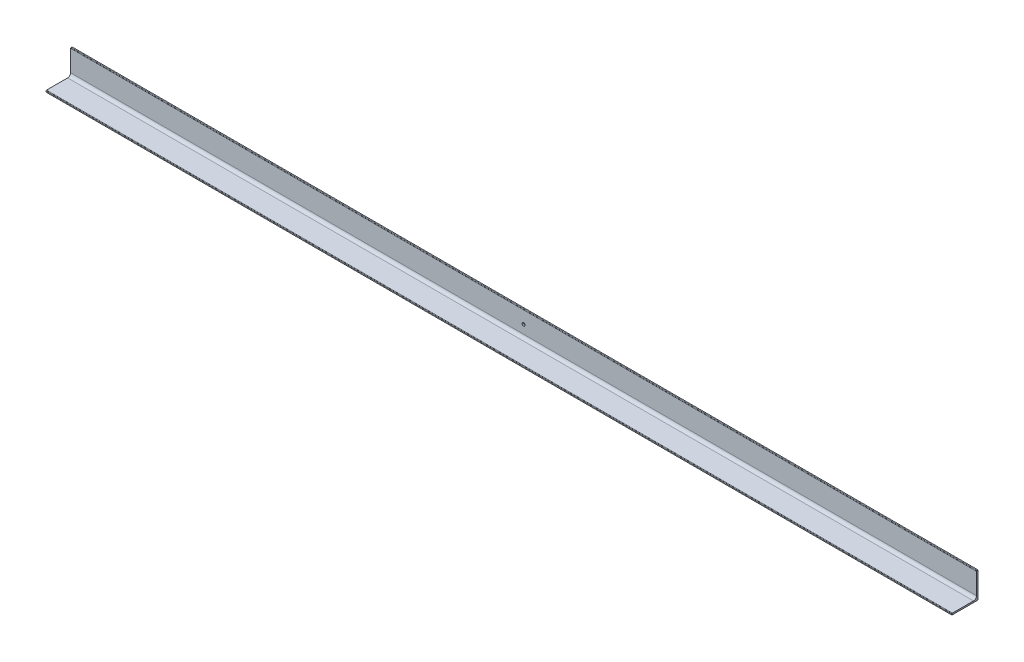
ISO-10303-21;
HEADER;
FILE_DESCRIPTION(('STEP AP214'),'2;1');
FILE_NAME('part.step','',(''),(''),'','','');
FILE_SCHEMA(('AUTOMOTIVE_DESIGN { 1 0 10303 214 1 1 1 1 }'));
ENDSEC;
DATA;
#1=APPLICATION_CONTEXT('core data for automotive mechanical design processes');
#2=APPLICATION_PROTOCOL_DEFINITION('international standard','automotive_design',2000,#1);
#3=PRODUCT_CONTEXT('',#1,'mechanical');
#4=PRODUCT('Part','Part','',(#3));
#5=PRODUCT_RELATED_PRODUCT_CATEGORY('part','',(#4));
#6=PRODUCT_DEFINITION_FORMATION('','',#4);
#7=PRODUCT_DEFINITION_CONTEXT('part definition',#1,'design');
#8=PRODUCT_DEFINITION('design','',#6,#7);
#9=PRODUCT_DEFINITION_SHAPE('','',#8);
#10=(LENGTH_UNIT() NAMED_UNIT(*) SI_UNIT(.MILLI.,.METRE.));
#11=(NAMED_UNIT(*) PLANE_ANGLE_UNIT() SI_UNIT($,.RADIAN.));
#12=(NAMED_UNIT(*) SI_UNIT($,.STERADIAN.) SOLID_ANGLE_UNIT());
#13=UNCERTAINTY_MEASURE_WITH_UNIT(LENGTH_MEASURE(1.E-05),#10,'distance_accuracy_value','');
#14=(GEOMETRIC_REPRESENTATION_CONTEXT(3) GLOBAL_UNCERTAINTY_ASSIGNED_CONTEXT((#13)) GLOBAL_UNIT_ASSIGNED_CONTEXT((#10,
#11,#12)) REPRESENTATION_CONTEXT('',''));
#15=CARTESIAN_POINT('',(0.,0.,0.));
#16=DIRECTION('',(0.,0.,1.));
#17=DIRECTION('',(1.,0.,0.));
#18=AXIS2_PLACEMENT_3D('',#15,#16,#17);
#19=CARTESIAN_POINT('',(1215.,0.,70.));
#20=DIRECTION('',(0.,0.,-1.));
#21=DIRECTION('',(-1.,0.,0.));
#22=AXIS2_PLACEMENT_3D('',#19,#20,#21);
#23=PLANE('',#22);
#24=DIRECTION('',(0.,-1.,0.));
#25=VECTOR('',#24,1.);
#26=CARTESIAN_POINT('',(-1215.,0.,70.));
#27=LINE('',#26,#25);
#28=CARTESIAN_POINT('',(-1215.,2.66666666666667,70.));
#29=VERTEX_POINT('',#28);
#30=CARTESIAN_POINT('',(-1215.,0.,70.));
#31=VERTEX_POINT('',#30);
#32=EDGE_CURVE('E135',#29,#31,#27,.T.);
#33=ORIENTED_EDGE('',*,*,#32,.T.);
#34=DIRECTION('',(-1.,0.,0.));
#35=VECTOR('',#34,1.);
#36=CARTESIAN_POINT('',(1215.,0.,70.));
#37=LINE('',#36,#35);
#38=CARTESIAN_POINT('',(1215.,0.,70.));
#39=VERTEX_POINT('',#38);
#40=EDGE_CURVE('E11',#39,#31,#37,.T.);
#41=ORIENTED_EDGE('',*,*,#40,.F.);
#42=DIRECTION('',(0.,-1.,0.));
#43=VECTOR('',#42,1.);
#44=CARTESIAN_POINT('',(1215.,0.,70.));
#45=LINE('',#44,#43);
#46=CARTESIAN_POINT('',(1215.,2.66666666666667,70.));
#47=VERTEX_POINT('',#46);
#48=EDGE_CURVE('E152',#47,#39,#45,.T.);
#49=ORIENTED_EDGE('',*,*,#48,.F.);
#50=DIRECTION('',(-1.,0.,0.));
#51=VECTOR('',#50,1.);
#52=CARTESIAN_POINT('',(1215.,2.66666666666667,70.));
#53=LINE('',#52,#51);
#54=EDGE_CURVE('E131',#47,#29,#53,.T.);
#55=ORIENTED_EDGE('',*,*,#54,.T.);
#56=EDGE_LOOP('',(#33,#41,#49,#55));
#57=FACE_BOUND('',#56,.T.);
#58=ADVANCED_FACE('F33',(#57),#23,.F.);
#59=CARTESIAN_POINT('',(1215.,0.,70.));
#60=DIRECTION('',(0.,1.,0.));
#61=DIRECTION('',(0.,0.,1.));
#62=AXIS2_PLACEMENT_3D('',#59,#60,#61);
#63=PLANE('',#62);
#64=DIRECTION('',(0.,0.,-1.));
#65=VECTOR('',#64,1.);
#66=CARTESIAN_POINT('',(-1215.,0.,70.));
#67=LINE('',#66,#65);
#68=CARTESIAN_POINT('',(-1215.,0.,0.));
#69=VERTEX_POINT('',#68);
#70=EDGE_CURVE('E138',#31,#69,#67,.T.);
#71=ORIENTED_EDGE('',*,*,#70,.T.);
#72=DIRECTION('',(-1.,0.,0.));
#73=VECTOR('',#72,1.);
#74=CARTESIAN_POINT('',(1215.,0.,0.));
#75=LINE('',#74,#73);
#76=CARTESIAN_POINT('',(1215.,0.,0.));
#77=VERTEX_POINT('',#76);
#78=EDGE_CURVE('E41',#77,#69,#75,.T.);
#79=ORIENTED_EDGE('',*,*,#78,.F.);
#80=DIRECTION('',(0.,0.,-1.));
#81=VECTOR('',#80,1.);
#82=CARTESIAN_POINT('',(1215.,0.,70.));
#83=LINE('',#82,#81);
#84=EDGE_CURVE('E95',#39,#77,#83,.T.);
#85=ORIENTED_EDGE('',*,*,#84,.F.);
#86=ORIENTED_EDGE('',*,*,#40,.T.);
#87=EDGE_LOOP('',(#71,#79,#85,#86));
#88=FACE_BOUND('',#87,.T.);
#89=ADVANCED_FACE('F224',(#88),#63,.F.);
#90=CARTESIAN_POINT('',(1215.,0.,0.));
#91=DIRECTION('',(0.,0.,1.));
#92=DIRECTION('',(1.,0.,0.));
#93=AXIS2_PLACEMENT_3D('',#90,#91,#92);
#94=PLANE('',#93);
#95=CARTESIAN_POINT('',(0.,35.,0.));
#96=DIRECTION('',(0.,0.,1.));
#97=DIRECTION('',(1.,0.,0.));
#98=AXIS2_PLACEMENT_3D('',#95,#96,#97);
#99=CIRCLE('',#98,4.);
#100=CARTESIAN_POINT('',(4.,35.,0.));
#101=VERTEX_POINT('',#100);
#102=EDGE_CURVE('E139',#101,#101,#99,.T.);
#103=ORIENTED_EDGE('',*,*,#102,.T.);
#104=EDGE_LOOP('',(#103));
#105=FACE_BOUND('',#104,.T.);
#106=DIRECTION('',(0.,1.,0.));
#107=VECTOR('',#106,1.);
#108=CARTESIAN_POINT('',(-1215.,0.,0.));
#109=LINE('',#108,#107);
#110=CARTESIAN_POINT('',(-1215.,70.,0.));
#111=VERTEX_POINT('',#110);
#112=EDGE_CURVE('E141',#69,#111,#109,.T.);
#113=ORIENTED_EDGE('',*,*,#112,.T.);
#114=DIRECTION('',(-1.,0.,0.));
#115=VECTOR('',#114,1.);
#116=CARTESIAN_POINT('',(1215.,70.,0.));
#117=LINE('',#116,#115);
#118=CARTESIAN_POINT('',(1215.,70.,0.));
#119=VERTEX_POINT('',#118);
#120=EDGE_CURVE('E162',#119,#111,#117,.T.);
#121=ORIENTED_EDGE('',*,*,#120,.F.);
#122=DIRECTION('',(0.,1.,0.));
#123=VECTOR('',#122,1.);
#124=CARTESIAN_POINT('',(1215.,0.,0.));
#125=LINE('',#124,#123);
#126=EDGE_CURVE('E170',#77,#119,#125,.T.);
#127=ORIENTED_EDGE('',*,*,#126,.F.);
#128=ORIENTED_EDGE('',*,*,#78,.T.);
#129=EDGE_LOOP('',(#113,#121,#127,#128));
#130=FACE_BOUND('',#129,.T.);
#131=ADVANCED_FACE('F168',(#105,#130),#94,.F.);
#132=CARTESIAN_POINT('',(1215.,70.,0.));
#133=DIRECTION('',(0.,-1.,0.));
#134=DIRECTION('',(0.,0.,-1.));
#135=AXIS2_PLACEMENT_3D('',#132,#133,#134);
#136=PLANE('',#135);
#137=DIRECTION('',(0.,0.,1.));
#138=VECTOR('',#137,1.);
#139=CARTESIAN_POINT('',(-1215.,70.,0.));
#140=LINE('',#139,#138);
#141=CARTESIAN_POINT('',(-1215.,70.,2.66666666666667));
#142=VERTEX_POINT('',#141);
#143=EDGE_CURVE('E143',#111,#142,#140,.T.);
#144=ORIENTED_EDGE('',*,*,#143,.T.);
#145=DIRECTION('',(-1.,0.,0.));
#146=VECTOR('',#145,1.);
#147=CARTESIAN_POINT('',(1215.,70.,2.66666666666667));
#148=LINE('',#147,#146);
#149=CARTESIAN_POINT('',(1215.,70.,2.66666666666667));
#150=VERTEX_POINT('',#149);
#151=EDGE_CURVE('E159',#150,#142,#148,.T.);
#152=ORIENTED_EDGE('',*,*,#151,.F.);
#153=DIRECTION('',(0.,0.,1.));
#154=VECTOR('',#153,1.);
#155=CARTESIAN_POINT('',(1215.,70.,0.));
#156=LINE('',#155,#154);
#157=EDGE_CURVE('E186',#119,#150,#156,.T.);
#158=ORIENTED_EDGE('',*,*,#157,.F.);
#159=ORIENTED_EDGE('',*,*,#120,.T.);
#160=EDGE_LOOP('',(#144,#152,#158,#159));
#161=FACE_BOUND('',#160,.T.);
#162=ADVANCED_FACE('F179',(#161),#136,.F.);
#163=CARTESIAN_POINT('',(1215.,68.6666666666667,2.66666666666667));
#164=DIRECTION('',(-1.,0.,0.));
#165=DIRECTION('',(0.,0.,1.));
#166=AXIS2_PLACEMENT_3D('',#163,#164,#165);
#167=CYLINDRICAL_SURFACE('',#166,1.33333333333334);
#168=CARTESIAN_POINT('',(-1215.,68.6666666666667,2.66666666666667));
#169=DIRECTION('',(1.,0.,0.));
#170=DIRECTION('',(0.,0.,-1.));
#171=AXIS2_PLACEMENT_3D('',#168,#169,#170);
#172=CIRCLE('',#171,1.33333333333334);
#173=CARTESIAN_POINT('',(-1215.,68.6666666666667,4.));
#174=VERTEX_POINT('',#173);
#175=EDGE_CURVE('E145',#142,#174,#172,.T.);
#176=ORIENTED_EDGE('',*,*,#175,.T.);
#177=DIRECTION('',(-1.,0.,0.));
#178=VECTOR('',#177,1.);
#179=CARTESIAN_POINT('',(1215.,68.6666666666667,4.));
#180=LINE('',#179,#178);
#181=CARTESIAN_POINT('',(1215.,68.6666666666667,4.));
#182=VERTEX_POINT('',#181);
#183=EDGE_CURVE('E156',#182,#174,#180,.T.);
#184=ORIENTED_EDGE('',*,*,#183,.F.);
#185=CARTESIAN_POINT('',(1215.,68.6666666666667,2.66666666666667));
#186=DIRECTION('',(1.,0.,0.));
#187=DIRECTION('',(0.,0.,-1.));
#188=AXIS2_PLACEMENT_3D('',#185,#186,#187);
#189=CIRCLE('',#188,1.33333333333334);
#190=EDGE_CURVE('E185',#150,#182,#189,.T.);
#191=ORIENTED_EDGE('',*,*,#190,.F.);
#192=ORIENTED_EDGE('',*,*,#151,.T.);
#193=EDGE_LOOP('',(#176,#184,#191,#192));
#194=FACE_BOUND('',#193,.T.);
#195=ADVANCED_FACE('F183',(#194),#167,.T.);
#196=CARTESIAN_POINT('',(1215.,12.,4.));
#197=DIRECTION('',(0.,0.,-1.));
#198=DIRECTION('',(-1.,0.,0.));
#199=AXIS2_PLACEMENT_3D('',#196,#197,#198);
#200=PLANE('',#199);
#201=CARTESIAN_POINT('',(0.,35.,4.));
#202=DIRECTION('',(0.,0.,1.));
#203=DIRECTION('',(1.,0.,0.));
#204=AXIS2_PLACEMENT_3D('',#201,#202,#203);
#205=CIRCLE('',#204,4.);
#206=CARTESIAN_POINT('',(4.,35.,4.));
#207=VERTEX_POINT('',#206);
#208=EDGE_CURVE('E193',#207,#207,#205,.T.);
#209=ORIENTED_EDGE('',*,*,#208,.F.);
#210=EDGE_LOOP('',(#209));
#211=FACE_BOUND('',#210,.T.);
#212=DIRECTION('',(0.,-1.,0.));
#213=VECTOR('',#212,1.);
#214=CARTESIAN_POINT('',(-1215.,12.,4.));
#215=LINE('',#214,#213);
#216=CARTESIAN_POINT('',(-1215.,12.,4.));
#217=VERTEX_POINT('',#216);
#218=EDGE_CURVE('E147',#174,#217,#215,.T.);
#219=ORIENTED_EDGE('',*,*,#218,.T.);
#220=DIRECTION('',(-1.,0.,0.));
#221=VECTOR('',#220,1.);
#222=CARTESIAN_POINT('',(1215.,12.,4.));
#223=LINE('',#222,#221);
#224=CARTESIAN_POINT('',(1215.,12.,4.));
#225=VERTEX_POINT('',#224);
#226=EDGE_CURVE('E126',#225,#217,#223,.T.);
#227=ORIENTED_EDGE('',*,*,#226,.F.);
#228=DIRECTION('',(0.,-1.,0.));
#229=VECTOR('',#228,1.);
#230=CARTESIAN_POINT('',(1215.,12.,4.));
#231=LINE('',#230,#229);
#232=EDGE_CURVE('E117',#182,#225,#231,.T.);
#233=ORIENTED_EDGE('',*,*,#232,.F.);
#234=ORIENTED_EDGE('',*,*,#183,.T.);
#235=EDGE_LOOP('',(#219,#227,#233,#234));
#236=FACE_BOUND('',#235,.T.);
#237=ADVANCED_FACE('F206',(#211,#236),#200,.F.);
#238=CARTESIAN_POINT('',(1215.,12.,12.));
#239=DIRECTION('',(-1.,0.,0.));
#240=DIRECTION('',(0.,0.,1.));
#241=AXIS2_PLACEMENT_3D('',#238,#239,#240);
#242=CYLINDRICAL_SURFACE('',#241,8.);
#243=CARTESIAN_POINT('',(-1215.,12.,12.));
#244=DIRECTION('',(-1.,0.,0.));
#245=DIRECTION('',(0.,0.,-1.));
#246=AXIS2_PLACEMENT_3D('',#243,#244,#245);
#247=CIRCLE('',#246,8.);
#248=CARTESIAN_POINT('',(-1215.,4.00000000000001,12.));
#249=VERTEX_POINT('',#248);
#250=EDGE_CURVE('E125',#217,#249,#247,.T.);
#251=ORIENTED_EDGE('',*,*,#250,.T.);
#252=DIRECTION('',(-1.,0.,0.));
#253=VECTOR('',#252,1.);
#254=CARTESIAN_POINT('',(1215.,4.00000000000001,12.));
#255=LINE('',#254,#253);
#256=CARTESIAN_POINT('',(1215.,4.00000000000001,12.));
#257=VERTEX_POINT('',#256);
#258=EDGE_CURVE('E122',#257,#249,#255,.T.);
#259=ORIENTED_EDGE('',*,*,#258,.F.);
#260=CARTESIAN_POINT('',(1215.,12.,12.));
#261=DIRECTION('',(-1.,0.,0.));
#262=DIRECTION('',(0.,0.,-1.));
#263=AXIS2_PLACEMENT_3D('',#260,#261,#262);
#264=CIRCLE('',#263,8.);
#265=EDGE_CURVE('E111',#225,#257,#264,.T.);
#266=ORIENTED_EDGE('',*,*,#265,.F.);
#267=ORIENTED_EDGE('',*,*,#226,.T.);
#268=EDGE_LOOP('',(#251,#259,#266,#267));
#269=FACE_BOUND('',#268,.T.);
#270=ADVANCED_FACE('F123',(#269),#242,.F.);
#271=CARTESIAN_POINT('',(1215.,4.,68.6666666666667));
#272=DIRECTION('',(0.,-1.,0.));
#273=DIRECTION('',(0.,0.,-1.));
#274=AXIS2_PLACEMENT_3D('',#271,#272,#273);
#275=PLANE('',#274);
#276=DIRECTION('',(0.,0.,1.));
#277=VECTOR('',#276,1.);
#278=CARTESIAN_POINT('',(-1215.,4.,68.6666666666667));
#279=LINE('',#278,#277);
#280=CARTESIAN_POINT('',(-1215.,4.,68.6666666666667));
#281=VERTEX_POINT('',#280);
#282=EDGE_CURVE('E81',#249,#281,#279,.T.);
#283=ORIENTED_EDGE('',*,*,#282,.T.);
#284=DIRECTION('',(-1.,0.,0.));
#285=VECTOR('',#284,1.);
#286=CARTESIAN_POINT('',(1215.,4.,68.6666666666667));
#287=LINE('',#286,#285);
#288=CARTESIAN_POINT('',(1215.,4.,68.6666666666667));
#289=VERTEX_POINT('',#288);
#290=EDGE_CURVE('E127',#289,#281,#287,.T.);
#291=ORIENTED_EDGE('',*,*,#290,.F.);
#292=DIRECTION('',(0.,0.,1.));
#293=VECTOR('',#292,1.);
#294=CARTESIAN_POINT('',(1215.,4.,68.6666666666667));
#295=LINE('',#294,#293);
#296=EDGE_CURVE('E115',#257,#289,#295,.T.);
#297=ORIENTED_EDGE('',*,*,#296,.F.);
#298=ORIENTED_EDGE('',*,*,#258,.T.);
#299=EDGE_LOOP('',(#283,#291,#297,#298));
#300=FACE_BOUND('',#299,.T.);
#301=ADVANCED_FACE('F129',(#300),#275,.F.);
#302=CARTESIAN_POINT('',(1215.,2.66666666666667,68.6666666666667));
#303=DIRECTION('',(-1.,0.,0.));
#304=DIRECTION('',(0.,0.,1.));
#305=AXIS2_PLACEMENT_3D('',#302,#303,#304);
#306=CYLINDRICAL_SURFACE('',#305,1.33333333333334);
#307=CARTESIAN_POINT('',(-1215.,2.66666666666667,68.6666666666667));
#308=DIRECTION('',(1.,0.,0.));
#309=DIRECTION('',(0.,0.,1.));
#310=AXIS2_PLACEMENT_3D('',#307,#308,#309);
#311=CIRCLE('',#310,1.33333333333334);
#312=EDGE_CURVE('E87',#281,#29,#311,.T.);
#313=ORIENTED_EDGE('',*,*,#312,.T.);
#314=ORIENTED_EDGE('',*,*,#54,.F.);
#315=CARTESIAN_POINT('',(1215.,2.66666666666667,68.6666666666667));
#316=DIRECTION('',(1.,0.,0.));
#317=DIRECTION('',(0.,0.,1.));
#318=AXIS2_PLACEMENT_3D('',#315,#316,#317);
#319=CIRCLE('',#318,1.33333333333334);
#320=EDGE_CURVE('E49',#289,#47,#319,.T.);
#321=ORIENTED_EDGE('',*,*,#320,.F.);
#322=ORIENTED_EDGE('',*,*,#290,.T.);
#323=EDGE_LOOP('',(#313,#314,#321,#322));
#324=FACE_BOUND('',#323,.T.);
#325=ADVANCED_FACE('F213',(#324),#306,.T.);
#326=CARTESIAN_POINT('',(1215.,2.66666666666667,68.6666666666667));
#327=DIRECTION('',(-1.,0.,0.));
#328=DIRECTION('',(0.,0.,1.));
#329=AXIS2_PLACEMENT_3D('',#326,#327,#328);
#330=PLANE('',#329);
#331=ORIENTED_EDGE('',*,*,#48,.T.);
#332=ORIENTED_EDGE('',*,*,#84,.T.);
#333=ORIENTED_EDGE('',*,*,#126,.T.);
#334=ORIENTED_EDGE('',*,*,#157,.T.);
#335=ORIENTED_EDGE('',*,*,#190,.T.);
#336=ORIENTED_EDGE('',*,*,#232,.T.);
#337=ORIENTED_EDGE('',*,*,#265,.T.);
#338=ORIENTED_EDGE('',*,*,#296,.T.);
#339=ORIENTED_EDGE('',*,*,#320,.T.);
#340=EDGE_LOOP('',(#331,#332,#333,#334,#335,#336,#337,#338,#339));
#341=FACE_BOUND('',#340,.T.);
#342=ADVANCED_FACE('F113',(#341),#330,.F.);
#343=CARTESIAN_POINT('',(-1215.,2.66666666666667,68.6666666666667));
#344=DIRECTION('',(-1.,0.,0.));
#345=DIRECTION('',(0.,0.,1.));
#346=AXIS2_PLACEMENT_3D('',#343,#344,#345);
#347=PLANE('',#346);
#348=ORIENTED_EDGE('',*,*,#32,.F.);
#349=ORIENTED_EDGE('',*,*,#312,.F.);
#350=ORIENTED_EDGE('',*,*,#282,.F.);
#351=ORIENTED_EDGE('',*,*,#250,.F.);
#352=ORIENTED_EDGE('',*,*,#218,.F.);
#353=ORIENTED_EDGE('',*,*,#175,.F.);
#354=ORIENTED_EDGE('',*,*,#143,.F.);
#355=ORIENTED_EDGE('',*,*,#112,.F.);
#356=ORIENTED_EDGE('',*,*,#70,.F.);
#357=EDGE_LOOP('',(#348,#349,#350,#351,#352,#353,#354,#355,#356));
#358=FACE_BOUND('',#357,.T.);
#359=ADVANCED_FACE('F174',(#358),#347,.T.);
#360=CARTESIAN_POINT('',(0.,35.,0.));
#361=DIRECTION('',(0.,0.,1.));
#362=DIRECTION('',(1.,0.,0.));
#363=AXIS2_PLACEMENT_3D('',#360,#361,#362);
#364=CYLINDRICAL_SURFACE('',#363,4.);
#365=ORIENTED_EDGE('',*,*,#102,.F.);
#366=EDGE_LOOP('',(#365));
#367=FACE_BOUND('',#366,.T.);
#368=ORIENTED_EDGE('',*,*,#208,.T.);
#369=EDGE_LOOP('',(#368));
#370=FACE_BOUND('',#369,.T.);
#371=ADVANCED_FACE('F200',(#367,#370),#364,.F.);
#372=CLOSED_SHELL('',(#58,#89,#131,#162,#195,#237,#270,#301,#325,#342,#359,#371));
#373=MANIFOLD_SOLID_BREP('B2',#372);
#374=ADVANCED_BREP_SHAPE_REPRESENTATION('',(#18,#373),#14);
#375=SHAPE_DEFINITION_REPRESENTATION(#9,#374);
ENDSEC;
END-ISO-10303-21;
